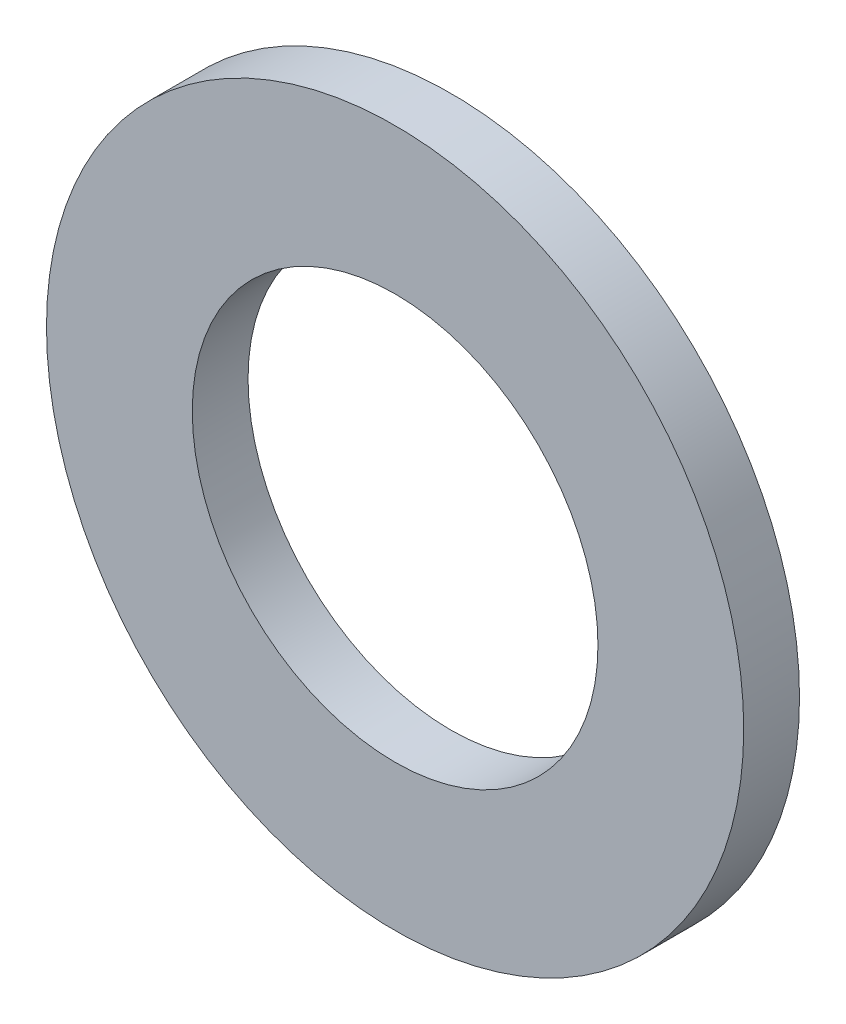
ISO-10303-21;
HEADER;
FILE_DESCRIPTION(('STEP AP214'),'2;1');
FILE_NAME('part.step','',(''),(''),'','','');
FILE_SCHEMA(('AUTOMOTIVE_DESIGN { 1 0 10303 214 1 1 1 1 }'));
ENDSEC;
DATA;
#1=APPLICATION_CONTEXT('core data for automotive mechanical design processes');
#2=APPLICATION_PROTOCOL_DEFINITION('international standard','automotive_design',2000,#1);
#3=PRODUCT_CONTEXT('',#1,'mechanical');
#4=PRODUCT('Part','Part','',(#3));
#5=PRODUCT_RELATED_PRODUCT_CATEGORY('part','',(#4));
#6=PRODUCT_DEFINITION_FORMATION('','',#4);
#7=PRODUCT_DEFINITION_CONTEXT('part definition',#1,'design');
#8=PRODUCT_DEFINITION('design','',#6,#7);
#9=PRODUCT_DEFINITION_SHAPE('','',#8);
#10=(LENGTH_UNIT() NAMED_UNIT(*) SI_UNIT(.MILLI.,.METRE.));
#11=(NAMED_UNIT(*) PLANE_ANGLE_UNIT() SI_UNIT($,.RADIAN.));
#12=(NAMED_UNIT(*) SI_UNIT($,.STERADIAN.) SOLID_ANGLE_UNIT());
#13=UNCERTAINTY_MEASURE_WITH_UNIT(LENGTH_MEASURE(1.E-05),#10,'distance_accuracy_value','');
#14=(GEOMETRIC_REPRESENTATION_CONTEXT(3) GLOBAL_UNCERTAINTY_ASSIGNED_CONTEXT((#13)) GLOBAL_UNIT_ASSIGNED_CONTEXT((#10,
#11,#12)) REPRESENTATION_CONTEXT('',''));
#15=CARTESIAN_POINT('',(0.,0.,0.));
#16=DIRECTION('',(0.,0.,1.));
#17=DIRECTION('',(1.,0.,0.));
#18=AXIS2_PLACEMENT_3D('',#15,#16,#17);
#19=CARTESIAN_POINT('',(0.,0.,0.2794));
#20=DIRECTION('',(0.,0.,1.));
#21=DIRECTION('',(1.,0.,0.));
#22=AXIS2_PLACEMENT_3D('',#19,#20,#21);
#23=PLANE('',#22);
#24=CARTESIAN_POINT('',(0.,0.,0.2794));
#25=DIRECTION('',(0.,0.,1.));
#26=DIRECTION('',(1.,0.,0.));
#27=AXIS2_PLACEMENT_3D('',#24,#25,#26);
#28=CIRCLE('',#27,3.4925);
#29=CARTESIAN_POINT('',(3.4925,0.,0.2794));
#30=VERTEX_POINT('',#29);
#31=EDGE_CURVE('E10',#30,#30,#28,.T.);
#32=ORIENTED_EDGE('',*,*,#31,.T.);
#33=EDGE_LOOP('',(#32));
#34=FACE_BOUND('',#33,.T.);
#35=CARTESIAN_POINT('',(0.,0.,0.2794));
#36=DIRECTION('',(0.,0.,1.));
#37=DIRECTION('',(1.,0.,0.));
#38=AXIS2_PLACEMENT_3D('',#35,#36,#37);
#39=CIRCLE('',#38,2.032);
#40=CARTESIAN_POINT('',(2.032,0.,0.2794));
#41=VERTEX_POINT('',#40);
#42=EDGE_CURVE('E52',#41,#41,#39,.T.);
#43=ORIENTED_EDGE('',*,*,#42,.F.);
#44=EDGE_LOOP('',(#43));
#45=FACE_BOUND('',#44,.T.);
#46=ADVANCED_FACE('F38',(#34,#45),#23,.T.);
#47=CARTESIAN_POINT('',(0.,0.,-0.2794));
#48=DIRECTION('',(0.,0.,1.));
#49=DIRECTION('',(1.,0.,0.));
#50=AXIS2_PLACEMENT_3D('',#47,#48,#49);
#51=PLANE('',#50);
#52=CARTESIAN_POINT('',(0.,0.,-0.2794));
#53=DIRECTION('',(0.,0.,1.));
#54=DIRECTION('',(1.,0.,0.));
#55=AXIS2_PLACEMENT_3D('',#52,#53,#54);
#56=CIRCLE('',#55,3.4925);
#57=CARTESIAN_POINT('',(3.4925,0.,-0.2794));
#58=VERTEX_POINT('',#57);
#59=EDGE_CURVE('E42',#58,#58,#56,.T.);
#60=ORIENTED_EDGE('',*,*,#59,.F.);
#61=EDGE_LOOP('',(#60));
#62=FACE_BOUND('',#61,.T.);
#63=CARTESIAN_POINT('',(0.,0.,-0.2794));
#64=DIRECTION('',(0.,0.,1.));
#65=DIRECTION('',(1.,0.,0.));
#66=AXIS2_PLACEMENT_3D('',#63,#64,#65);
#67=CIRCLE('',#66,2.032);
#68=CARTESIAN_POINT('',(2.032,0.,-0.2794));
#69=VERTEX_POINT('',#68);
#70=EDGE_CURVE('E54',#69,#69,#67,.T.);
#71=ORIENTED_EDGE('',*,*,#70,.T.);
#72=EDGE_LOOP('',(#71));
#73=FACE_BOUND('',#72,.T.);
#74=ADVANCED_FACE('F67',(#62,#73),#51,.F.);
#75=CARTESIAN_POINT('',(0.,0.,0.2794));
#76=DIRECTION('',(0.,0.,-1.));
#77=DIRECTION('',(-1.,0.,0.));
#78=AXIS2_PLACEMENT_3D('',#75,#76,#77);
#79=CYLINDRICAL_SURFACE('',#78,3.4925);
#80=ORIENTED_EDGE('',*,*,#31,.F.);
#81=EDGE_LOOP('',(#80));
#82=FACE_BOUND('',#81,.T.);
#83=ORIENTED_EDGE('',*,*,#59,.T.);
#84=EDGE_LOOP('',(#83));
#85=FACE_BOUND('',#84,.T.);
#86=ADVANCED_FACE('F40',(#82,#85),#79,.T.);
#87=CARTESIAN_POINT('',(0.,0.,0.2794));
#88=DIRECTION('',(0.,0.,-1.));
#89=DIRECTION('',(-1.,0.,0.));
#90=AXIS2_PLACEMENT_3D('',#87,#88,#89);
#91=CYLINDRICAL_SURFACE('',#90,2.032);
#92=ORIENTED_EDGE('',*,*,#42,.T.);
#93=EDGE_LOOP('',(#92));
#94=FACE_BOUND('',#93,.T.);
#95=ORIENTED_EDGE('',*,*,#70,.F.);
#96=EDGE_LOOP('',(#95));
#97=FACE_BOUND('',#96,.T.);
#98=ADVANCED_FACE('F63',(#94,#97),#91,.F.);
#99=CLOSED_SHELL('',(#46,#74,#86,#98));
#100=MANIFOLD_SOLID_BREP('B2',#99);
#101=ADVANCED_BREP_SHAPE_REPRESENTATION('',(#18,#100),#14);
#102=SHAPE_DEFINITION_REPRESENTATION(#9,#101);
ENDSEC;
END-ISO-10303-21;
